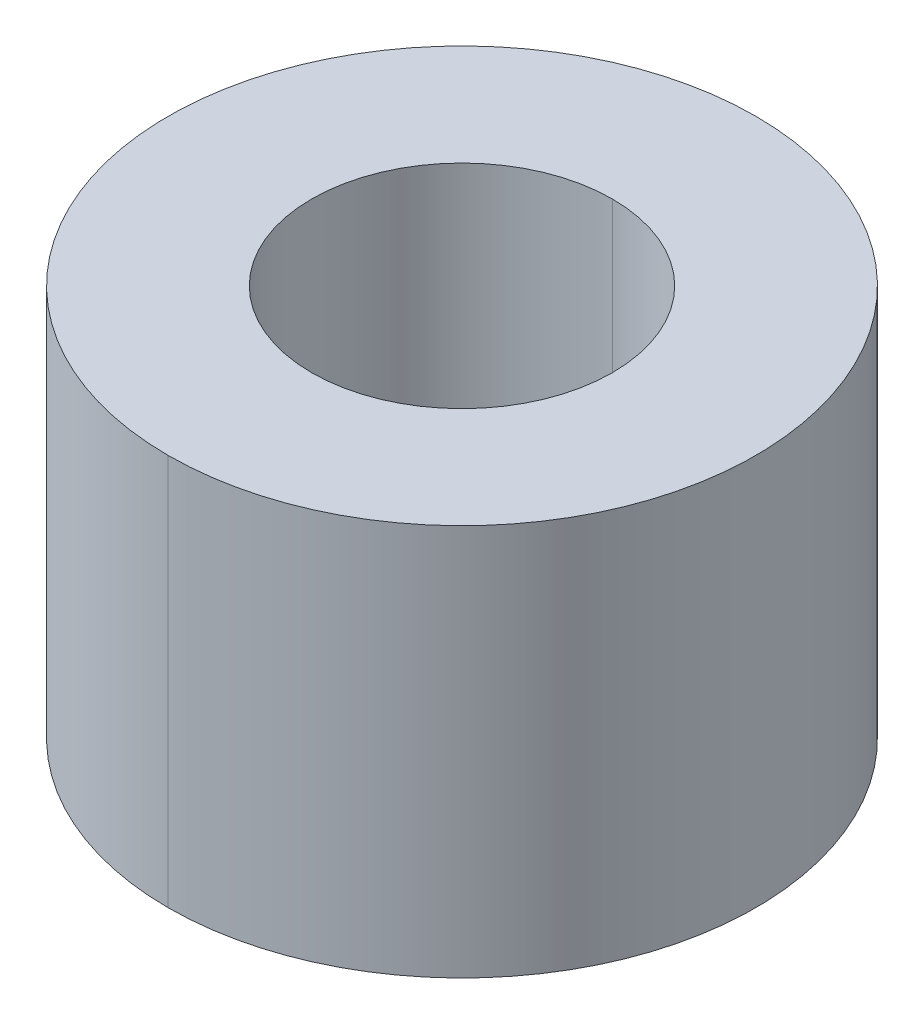
ISO-10303-21;
HEADER;
FILE_DESCRIPTION(('STEP AP214'),'2;1');
FILE_NAME('part.step','',(''),(''),'','','');
FILE_SCHEMA(('AUTOMOTIVE_DESIGN { 1 0 10303 214 1 1 1 1 }'));
ENDSEC;
DATA;
#1=APPLICATION_CONTEXT('core data for automotive mechanical design processes');
#2=APPLICATION_PROTOCOL_DEFINITION('international standard','automotive_design',2000,#1);
#3=PRODUCT_CONTEXT('',#1,'mechanical');
#4=PRODUCT('Part','Part','',(#3));
#5=PRODUCT_RELATED_PRODUCT_CATEGORY('part','',(#4));
#6=PRODUCT_DEFINITION_FORMATION('','',#4);
#7=PRODUCT_DEFINITION_CONTEXT('part definition',#1,'design');
#8=PRODUCT_DEFINITION('design','',#6,#7);
#9=PRODUCT_DEFINITION_SHAPE('','',#8);
#10=(LENGTH_UNIT() NAMED_UNIT(*) SI_UNIT(.MILLI.,.METRE.));
#11=(NAMED_UNIT(*) PLANE_ANGLE_UNIT() SI_UNIT($,.RADIAN.));
#12=(NAMED_UNIT(*) SI_UNIT($,.STERADIAN.) SOLID_ANGLE_UNIT());
#13=UNCERTAINTY_MEASURE_WITH_UNIT(LENGTH_MEASURE(1.E-05),#10,'distance_accuracy_value','');
#14=(GEOMETRIC_REPRESENTATION_CONTEXT(3) GLOBAL_UNCERTAINTY_ASSIGNED_CONTEXT((#13)) GLOBAL_UNIT_ASSIGNED_CONTEXT((#10,
#11,#12)) REPRESENTATION_CONTEXT('',''));
#15=CARTESIAN_POINT('',(0.,0.,0.));
#16=DIRECTION('',(0.,0.,1.));
#17=DIRECTION('',(1.,0.,0.));
#18=AXIS2_PLACEMENT_3D('',#15,#16,#17);
#19=CARTESIAN_POINT('',(0.,6.35,0.));
#20=DIRECTION('',(0.,-1.,0.));
#21=DIRECTION('',(0.,0.,-1.));
#22=AXIS2_PLACEMENT_3D('',#19,#20,#21);
#23=CYLINDRICAL_SURFACE('',#22,2.4384);
#24=DIRECTION('',(0.,-1.,0.));
#25=VECTOR('',#24,1.);
#26=CARTESIAN_POINT('',(0.,6.35,2.4384));
#27=LINE('',#26,#25);
#28=CARTESIAN_POINT('',(0.,6.35,2.4384));
#29=VERTEX_POINT('',#28);
#30=CARTESIAN_POINT('',(0.,0.,2.4384));
#31=VERTEX_POINT('',#30);
#32=EDGE_CURVE('E76',#29,#31,#27,.T.);
#33=ORIENTED_EDGE('',*,*,#32,.F.);
#34=CARTESIAN_POINT('',(0.,6.35,0.));
#35=DIRECTION('',(0.,1.,0.));
#36=DIRECTION('',(0.,0.,1.));
#37=AXIS2_PLACEMENT_3D('',#34,#35,#36);
#38=CIRCLE('',#37,2.4384);
#39=CARTESIAN_POINT('',(0.,6.35,-2.4384));
#40=VERTEX_POINT('',#39);
#41=EDGE_CURVE('E71',#29,#40,#38,.T.);
#42=ORIENTED_EDGE('',*,*,#41,.T.);
#43=DIRECTION('',(0.,-1.,0.));
#44=VECTOR('',#43,1.);
#45=CARTESIAN_POINT('',(0.,6.35,-2.4384));
#46=LINE('',#45,#44);
#47=CARTESIAN_POINT('',(0.,0.,-2.4384));
#48=VERTEX_POINT('',#47);
#49=EDGE_CURVE('E73',#40,#48,#46,.T.);
#50=ORIENTED_EDGE('',*,*,#49,.T.);
#51=CARTESIAN_POINT('',(0.,0.,0.));
#52=DIRECTION('',(0.,1.,0.));
#53=DIRECTION('',(0.,0.,1.));
#54=AXIS2_PLACEMENT_3D('',#51,#52,#53);
#55=CIRCLE('',#54,2.4384);
#56=EDGE_CURVE('E11',#31,#48,#55,.T.);
#57=ORIENTED_EDGE('',*,*,#56,.F.);
#58=EDGE_LOOP('',(#33,#42,#50,#57));
#59=FACE_BOUND('',#58,.T.);
#60=ADVANCED_FACE('F17',(#59),#23,.F.);
#61=CARTESIAN_POINT('',(0.,6.35,0.));
#62=DIRECTION('',(0.,-1.,0.));
#63=DIRECTION('',(0.,0.,-1.));
#64=AXIS2_PLACEMENT_3D('',#61,#62,#63);
#65=CYLINDRICAL_SURFACE('',#64,4.7625);
#66=DIRECTION('',(0.,-1.,0.));
#67=VECTOR('',#66,1.);
#68=CARTESIAN_POINT('',(0.,6.35,4.7625));
#69=LINE('',#68,#67);
#70=CARTESIAN_POINT('',(0.,6.35,4.7625));
#71=VERTEX_POINT('',#70);
#72=CARTESIAN_POINT('',(0.,0.,4.7625));
#73=VERTEX_POINT('',#72);
#74=EDGE_CURVE('E109',#71,#73,#69,.T.);
#75=ORIENTED_EDGE('',*,*,#74,.F.);
#76=CARTESIAN_POINT('',(0.,6.35,0.));
#77=DIRECTION('',(0.,1.,0.));
#78=DIRECTION('',(0.,0.,1.));
#79=AXIS2_PLACEMENT_3D('',#76,#77,#78);
#80=CIRCLE('',#79,4.7625);
#81=CARTESIAN_POINT('',(0.,6.35,-4.7625));
#82=VERTEX_POINT('',#81);
#83=EDGE_CURVE('E81',#82,#71,#80,.T.);
#84=ORIENTED_EDGE('',*,*,#83,.F.);
#85=DIRECTION('',(0.,-1.,0.));
#86=VECTOR('',#85,1.);
#87=CARTESIAN_POINT('',(0.,6.35,-4.7625));
#88=LINE('',#87,#86);
#89=CARTESIAN_POINT('',(0.,0.,-4.7625));
#90=VERTEX_POINT('',#89);
#91=EDGE_CURVE('E105',#82,#90,#88,.T.);
#92=ORIENTED_EDGE('',*,*,#91,.T.);
#93=CARTESIAN_POINT('',(0.,0.,0.));
#94=DIRECTION('',(0.,1.,0.));
#95=DIRECTION('',(0.,0.,1.));
#96=AXIS2_PLACEMENT_3D('',#93,#94,#95);
#97=CIRCLE('',#96,4.7625);
#98=EDGE_CURVE('E20',#90,#73,#97,.T.);
#99=ORIENTED_EDGE('',*,*,#98,.T.);
#100=EDGE_LOOP('',(#75,#84,#92,#99));
#101=FACE_BOUND('',#100,.T.);
#102=ADVANCED_FACE('F121',(#101),#65,.T.);
#103=CARTESIAN_POINT('',(0.,0.,0.));
#104=DIRECTION('',(0.,1.,0.));
#105=DIRECTION('',(1.,0.,0.));
#106=AXIS2_PLACEMENT_3D('',#103,#104,#105);
#107=PLANE('',#106);
#108=CARTESIAN_POINT('',(0.,0.,0.));
#109=DIRECTION('',(0.,1.,0.));
#110=DIRECTION('',(0.,0.,1.));
#111=AXIS2_PLACEMENT_3D('',#108,#109,#110);
#112=CIRCLE('',#111,2.4384);
#113=EDGE_CURVE('E87',#48,#31,#112,.T.);
#114=ORIENTED_EDGE('',*,*,#113,.T.);
#115=ORIENTED_EDGE('',*,*,#56,.T.);
#116=EDGE_LOOP('',(#114,#115));
#117=FACE_BOUND('',#116,.T.);
#118=ORIENTED_EDGE('',*,*,#98,.F.);
#119=CARTESIAN_POINT('',(0.,0.,0.));
#120=DIRECTION('',(0.,1.,0.));
#121=DIRECTION('',(0.,0.,1.));
#122=AXIS2_PLACEMENT_3D('',#119,#120,#121);
#123=CIRCLE('',#122,4.7625);
#124=EDGE_CURVE('E113',#73,#90,#123,.T.);
#125=ORIENTED_EDGE('',*,*,#124,.F.);
#126=EDGE_LOOP('',(#118,#125));
#127=FACE_BOUND('',#126,.T.);
#128=ADVANCED_FACE('F125',(#117,#127),#107,.F.);
#129=CARTESIAN_POINT('',(0.,6.35,0.));
#130=DIRECTION('',(0.,1.,0.));
#131=DIRECTION('',(1.,0.,0.));
#132=AXIS2_PLACEMENT_3D('',#129,#130,#131);
#133=PLANE('',#132);
#134=CARTESIAN_POINT('',(0.,6.35,0.));
#135=DIRECTION('',(0.,1.,0.));
#136=DIRECTION('',(0.,0.,1.));
#137=AXIS2_PLACEMENT_3D('',#134,#135,#136);
#138=CIRCLE('',#137,2.4384);
#139=EDGE_CURVE('E85',#40,#29,#138,.T.);
#140=ORIENTED_EDGE('',*,*,#139,.F.);
#141=ORIENTED_EDGE('',*,*,#41,.F.);
#142=EDGE_LOOP('',(#140,#141));
#143=FACE_BOUND('',#142,.T.);
#144=ORIENTED_EDGE('',*,*,#83,.T.);
#145=CARTESIAN_POINT('',(0.,6.35,0.));
#146=DIRECTION('',(0.,1.,0.));
#147=DIRECTION('',(0.,0.,1.));
#148=AXIS2_PLACEMENT_3D('',#145,#146,#147);
#149=CIRCLE('',#148,4.7625);
#150=EDGE_CURVE('E89',#71,#82,#149,.T.);
#151=ORIENTED_EDGE('',*,*,#150,.T.);
#152=EDGE_LOOP('',(#144,#151));
#153=FACE_BOUND('',#152,.T.);
#154=ADVANCED_FACE('F91',(#143,#153),#133,.T.);
#155=CARTESIAN_POINT('',(0.,6.35,0.));
#156=DIRECTION('',(0.,-1.,0.));
#157=DIRECTION('',(0.,0.,-1.));
#158=AXIS2_PLACEMENT_3D('',#155,#156,#157);
#159=CYLINDRICAL_SURFACE('',#158,4.7625);
#160=ORIENTED_EDGE('',*,*,#150,.F.);
#161=ORIENTED_EDGE('',*,*,#74,.T.);
#162=ORIENTED_EDGE('',*,*,#124,.T.);
#163=ORIENTED_EDGE('',*,*,#91,.F.);
#164=EDGE_LOOP('',(#160,#161,#162,#163));
#165=FACE_BOUND('',#164,.T.);
#166=ADVANCED_FACE('F124',(#165),#159,.T.);
#167=CARTESIAN_POINT('',(0.,6.35,0.));
#168=DIRECTION('',(0.,-1.,0.));
#169=DIRECTION('',(0.,0.,-1.));
#170=AXIS2_PLACEMENT_3D('',#167,#168,#169);
#171=CYLINDRICAL_SURFACE('',#170,2.4384);
#172=ORIENTED_EDGE('',*,*,#139,.T.);
#173=ORIENTED_EDGE('',*,*,#32,.T.);
#174=ORIENTED_EDGE('',*,*,#113,.F.);
#175=ORIENTED_EDGE('',*,*,#49,.F.);
#176=EDGE_LOOP('',(#172,#173,#174,#175));
#177=FACE_BOUND('',#176,.T.);
#178=ADVANCED_FACE('F84',(#177),#171,.F.);
#179=CLOSED_SHELL('',(#60,#102,#128,#154,#166,#178));
#180=MANIFOLD_SOLID_BREP('B1',#179);
#181=ADVANCED_BREP_SHAPE_REPRESENTATION('',(#18,#180),#14);
#182=SHAPE_DEFINITION_REPRESENTATION(#9,#181);
ENDSEC;
END-ISO-10303-21;
